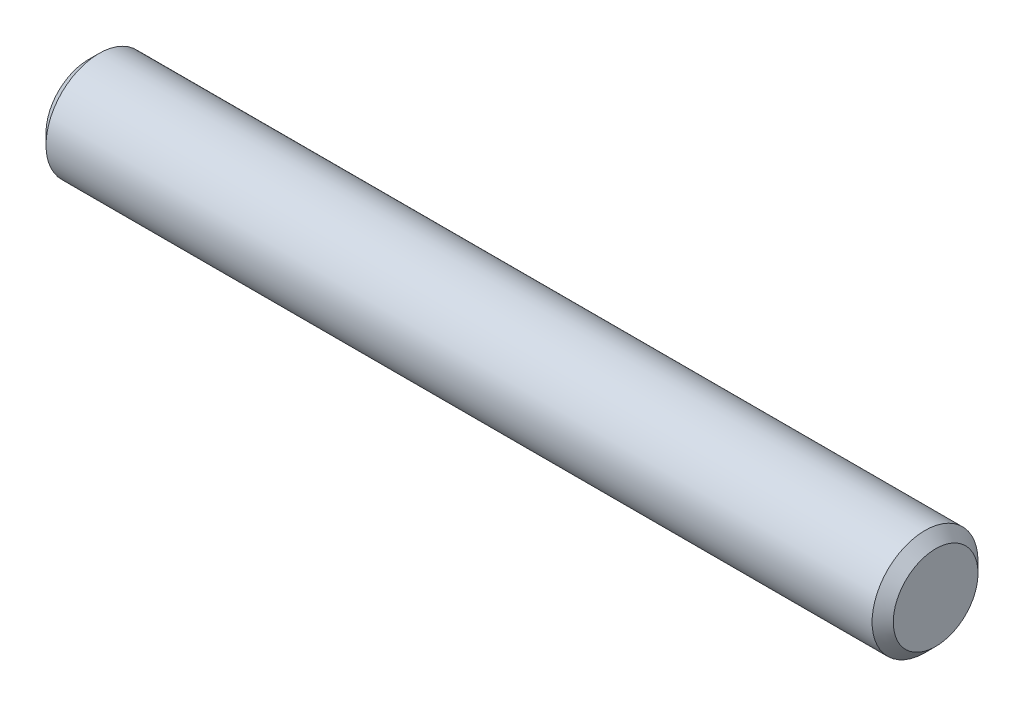
ISO-10303-21;
HEADER;
FILE_DESCRIPTION(('STEP AP214'),'2;1');
FILE_NAME('part.step','',(''),(''),'','','');
FILE_SCHEMA(('AUTOMOTIVE_DESIGN { 1 0 10303 214 1 1 1 1 }'));
ENDSEC;
DATA;
#1=APPLICATION_CONTEXT('core data for automotive mechanical design processes');
#2=APPLICATION_PROTOCOL_DEFINITION('international standard','automotive_design',2000,#1);
#3=PRODUCT_CONTEXT('',#1,'mechanical');
#4=PRODUCT('Part','Part','',(#3));
#5=PRODUCT_RELATED_PRODUCT_CATEGORY('part','',(#4));
#6=PRODUCT_DEFINITION_FORMATION('','',#4);
#7=PRODUCT_DEFINITION_CONTEXT('part definition',#1,'design');
#8=PRODUCT_DEFINITION('design','',#6,#7);
#9=PRODUCT_DEFINITION_SHAPE('','',#8);
#10=(LENGTH_UNIT() NAMED_UNIT(*) SI_UNIT(.MILLI.,.METRE.));
#11=(NAMED_UNIT(*) PLANE_ANGLE_UNIT() SI_UNIT($,.RADIAN.));
#12=(NAMED_UNIT(*) SI_UNIT($,.STERADIAN.) SOLID_ANGLE_UNIT());
#13=UNCERTAINTY_MEASURE_WITH_UNIT(LENGTH_MEASURE(1.E-05),#10,'distance_accuracy_value','');
#14=(GEOMETRIC_REPRESENTATION_CONTEXT(3) GLOBAL_UNCERTAINTY_ASSIGNED_CONTEXT((#13)) GLOBAL_UNIT_ASSIGNED_CONTEXT((#10,
#11,#12)) REPRESENTATION_CONTEXT('',''));
#15=CARTESIAN_POINT('',(0.,0.,0.));
#16=DIRECTION('',(0.,0.,1.));
#17=DIRECTION('',(1.,0.,0.));
#18=AXIS2_PLACEMENT_3D('',#15,#16,#17);
#19=CARTESIAN_POINT('',(-6.35,0.,0.));
#20=DIRECTION('',(1.,0.,0.));
#21=DIRECTION('',(0.,0.,-1.));
#22=AXIS2_PLACEMENT_3D('',#19,#20,#21);
#23=CYLINDRICAL_SURFACE('',#22,0.79375);
#24=CARTESIAN_POINT('',(6.19125,0.,0.));
#25=DIRECTION('',(1.,0.,0.));
#26=DIRECTION('',(0.,0.,-1.));
#27=AXIS2_PLACEMENT_3D('',#24,#25,#26);
#28=CIRCLE('',#27,0.79375);
#29=CARTESIAN_POINT('',(6.19125,0.,-0.79375));
#30=VERTEX_POINT('',#29);
#31=EDGE_CURVE('E37',#30,#30,#28,.F.);
#32=ORIENTED_EDGE('',*,*,#31,.T.);
#33=EDGE_LOOP('',(#32));
#34=FACE_BOUND('',#33,.T.);
#35=CARTESIAN_POINT('',(-6.19125,0.,0.));
#36=DIRECTION('',(1.,0.,0.));
#37=DIRECTION('',(0.,0.,-1.));
#38=AXIS2_PLACEMENT_3D('',#35,#36,#37);
#39=CIRCLE('',#38,0.79375);
#40=CARTESIAN_POINT('',(-6.19125,0.,-0.79375));
#41=VERTEX_POINT('',#40);
#42=EDGE_CURVE('E41',#41,#41,#39,.T.);
#43=ORIENTED_EDGE('',*,*,#42,.T.);
#44=EDGE_LOOP('',(#43));
#45=FACE_BOUND('',#44,.T.);
#46=ADVANCED_FACE('F30',(#34,#45),#23,.T.);
#47=CARTESIAN_POINT('',(-6.35,0.,0.));
#48=DIRECTION('',(1.,0.,0.));
#49=DIRECTION('',(0.,0.,-1.));
#50=AXIS2_PLACEMENT_3D('',#47,#48,#49);
#51=PLANE('',#50);
#52=CARTESIAN_POINT('',(-6.35,0.,0.));
#53=DIRECTION('',(1.,0.,0.));
#54=DIRECTION('',(0.,0.,-1.));
#55=AXIS2_PLACEMENT_3D('',#52,#53,#54);
#56=CIRCLE('',#55,0.634999999999997);
#57=CARTESIAN_POINT('',(-6.35,0.,-0.634999999999997));
#58=VERTEX_POINT('',#57);
#59=EDGE_CURVE('E10',#58,#58,#56,.F.);
#60=ORIENTED_EDGE('',*,*,#59,.T.);
#61=EDGE_LOOP('',(#60));
#62=FACE_BOUND('',#61,.T.);
#63=ADVANCED_FACE('F61',(#62),#51,.F.);
#64=CARTESIAN_POINT('',(6.35,0.,0.));
#65=DIRECTION('',(1.,0.,0.));
#66=DIRECTION('',(0.,0.,-1.));
#67=AXIS2_PLACEMENT_3D('',#64,#65,#66);
#68=PLANE('',#67);
#69=CARTESIAN_POINT('',(6.35,0.,0.));
#70=DIRECTION('',(1.,0.,0.));
#71=DIRECTION('',(0.,0.,-1.));
#72=AXIS2_PLACEMENT_3D('',#69,#70,#71);
#73=CIRCLE('',#72,0.635);
#74=CARTESIAN_POINT('',(6.35,0.,-0.635));
#75=VERTEX_POINT('',#74);
#76=EDGE_CURVE('E45',#75,#75,#73,.T.);
#77=ORIENTED_EDGE('',*,*,#76,.T.);
#78=EDGE_LOOP('',(#77));
#79=FACE_BOUND('',#78,.T.);
#80=ADVANCED_FACE('F51',(#79),#68,.T.);
#81=CARTESIAN_POINT('',(6.35,0.,0.));
#82=DIRECTION('',(-1.,0.,0.));
#83=DIRECTION('',(0.,0.,1.));
#84=AXIS2_PLACEMENT_3D('',#81,#82,#83);
#85=CONICAL_SURFACE('',#84,0.635,0.785398163397445);
#86=ORIENTED_EDGE('',*,*,#31,.F.);
#87=EDGE_LOOP('',(#86));
#88=FACE_BOUND('',#87,.T.);
#89=ORIENTED_EDGE('',*,*,#76,.F.);
#90=EDGE_LOOP('',(#89));
#91=FACE_BOUND('',#90,.T.);
#92=ADVANCED_FACE('F53',(#88,#91),#85,.T.);
#93=CARTESIAN_POINT('',(-6.19125,0.,0.));
#94=DIRECTION('',(1.,0.,0.));
#95=DIRECTION('',(0.,0.,-1.));
#96=AXIS2_PLACEMENT_3D('',#93,#94,#95);
#97=CONICAL_SURFACE('',#96,0.79375,0.78539816339745);
#98=ORIENTED_EDGE('',*,*,#59,.F.);
#99=EDGE_LOOP('',(#98));
#100=FACE_BOUND('',#99,.T.);
#101=ORIENTED_EDGE('',*,*,#42,.F.);
#102=EDGE_LOOP('',(#101));
#103=FACE_BOUND('',#102,.T.);
#104=ADVANCED_FACE('F32',(#100,#103),#97,.T.);
#105=CLOSED_SHELL('',(#46,#63,#80,#92,#104));
#106=MANIFOLD_SOLID_BREP('B2',#105);
#107=ADVANCED_BREP_SHAPE_REPRESENTATION('',(#18,#106),#14);
#108=SHAPE_DEFINITION_REPRESENTATION(#9,#107);
ENDSEC;
END-ISO-10303-21;
